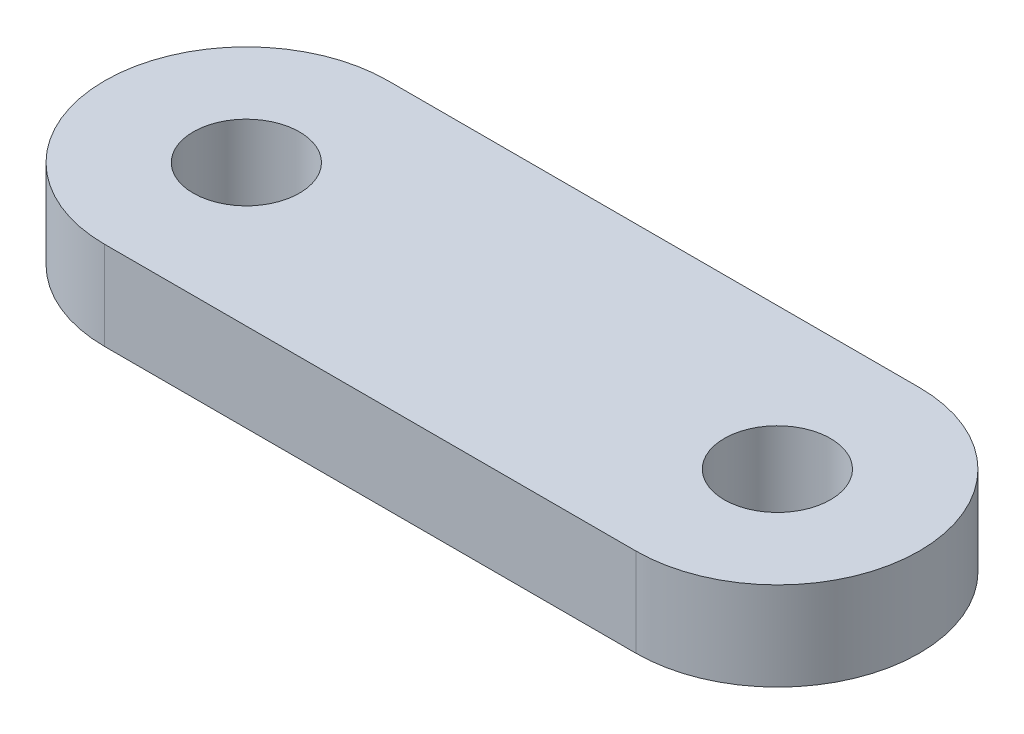
ISO-10303-21;
HEADER;
FILE_DESCRIPTION(('STEP AP214'),'2;1');
FILE_NAME('part.step','',(''),(''),'','','');
FILE_SCHEMA(('AUTOMOTIVE_DESIGN { 1 0 10303 214 1 1 1 1 }'));
ENDSEC;
DATA;
#1=APPLICATION_CONTEXT('core data for automotive mechanical design processes');
#2=APPLICATION_PROTOCOL_DEFINITION('international standard','automotive_design',2000,#1);
#3=PRODUCT_CONTEXT('',#1,'mechanical');
#4=PRODUCT('Part','Part','',(#3));
#5=PRODUCT_RELATED_PRODUCT_CATEGORY('part','',(#4));
#6=PRODUCT_DEFINITION_FORMATION('','',#4);
#7=PRODUCT_DEFINITION_CONTEXT('part definition',#1,'design');
#8=PRODUCT_DEFINITION('design','',#6,#7);
#9=PRODUCT_DEFINITION_SHAPE('','',#8);
#10=(LENGTH_UNIT() NAMED_UNIT(*) SI_UNIT(.MILLI.,.METRE.));
#11=(NAMED_UNIT(*) PLANE_ANGLE_UNIT() SI_UNIT($,.RADIAN.));
#12=(NAMED_UNIT(*) SI_UNIT($,.STERADIAN.) SOLID_ANGLE_UNIT());
#13=UNCERTAINTY_MEASURE_WITH_UNIT(LENGTH_MEASURE(1.E-05),#10,'distance_accuracy_value','');
#14=(GEOMETRIC_REPRESENTATION_CONTEXT(3) GLOBAL_UNCERTAINTY_ASSIGNED_CONTEXT((#13)) GLOBAL_UNIT_ASSIGNED_CONTEXT((#10,
#11,#12)) REPRESENTATION_CONTEXT('',''));
#15=CARTESIAN_POINT('',(0.,0.,0.));
#16=DIRECTION('',(0.,0.,1.));
#17=DIRECTION('',(1.,0.,0.));
#18=AXIS2_PLACEMENT_3D('',#15,#16,#17);
#19=CARTESIAN_POINT('',(0.,2.5,0.));
#20=DIRECTION('',(0.,-1.,0.));
#21=DIRECTION('',(0.,0.,-1.));
#22=AXIS2_PLACEMENT_3D('',#19,#20,#21);
#23=CYLINDRICAL_SURFACE('',#22,4.);
#24=CARTESIAN_POINT('',(0.,0.,0.));
#25=DIRECTION('',(0.,1.,0.));
#26=DIRECTION('',(0.,0.,1.));
#27=AXIS2_PLACEMENT_3D('',#24,#25,#26);
#28=CIRCLE('',#27,4.);
#29=CARTESIAN_POINT('',(0.,0.,-4.));
#30=VERTEX_POINT('',#29);
#31=CARTESIAN_POINT('',(0.,0.,4.));
#32=VERTEX_POINT('',#31);
#33=EDGE_CURVE('E95',#30,#32,#28,.T.);
#34=ORIENTED_EDGE('',*,*,#33,.T.);
#35=DIRECTION('',(0.,-1.,0.));
#36=VECTOR('',#35,1.);
#37=CARTESIAN_POINT('',(0.,2.5,4.));
#38=LINE('',#37,#36);
#39=CARTESIAN_POINT('',(0.,2.5,4.));
#40=VERTEX_POINT('',#39);
#41=EDGE_CURVE('E11',#40,#32,#38,.T.);
#42=ORIENTED_EDGE('',*,*,#41,.F.);
#43=CARTESIAN_POINT('',(0.,2.5,0.));
#44=DIRECTION('',(0.,1.,0.));
#45=DIRECTION('',(0.,0.,1.));
#46=AXIS2_PLACEMENT_3D('',#43,#44,#45);
#47=CIRCLE('',#46,4.);
#48=CARTESIAN_POINT('',(0.,2.5,-4.));
#49=VERTEX_POINT('',#48);
#50=EDGE_CURVE('E83',#49,#40,#47,.T.);
#51=ORIENTED_EDGE('',*,*,#50,.F.);
#52=DIRECTION('',(0.,-1.,0.));
#53=VECTOR('',#52,1.);
#54=CARTESIAN_POINT('',(0.,2.5,-4.));
#55=LINE('',#54,#53);
#56=EDGE_CURVE('E91',#49,#30,#55,.T.);
#57=ORIENTED_EDGE('',*,*,#56,.T.);
#58=EDGE_LOOP('',(#34,#42,#51,#57));
#59=FACE_BOUND('',#58,.T.);
#60=ADVANCED_FACE('F32',(#59),#23,.T.);
#61=CARTESIAN_POINT('',(0.,2.5,4.));
#62=DIRECTION('',(0.,0.,-1.));
#63=DIRECTION('',(-1.,0.,0.));
#64=AXIS2_PLACEMENT_3D('',#61,#62,#63);
#65=PLANE('',#64);
#66=DIRECTION('',(1.,0.,0.));
#67=VECTOR('',#66,1.);
#68=CARTESIAN_POINT('',(0.,0.,4.));
#69=LINE('',#68,#67);
#70=CARTESIAN_POINT('',(15.0000000000001,0.,4.));
#71=VERTEX_POINT('',#70);
#72=EDGE_CURVE('E87',#32,#71,#69,.T.);
#73=ORIENTED_EDGE('',*,*,#72,.T.);
#74=DIRECTION('',(0.,-1.,0.));
#75=VECTOR('',#74,1.);
#76=CARTESIAN_POINT('',(15.0000000000001,2.5,4.));
#77=LINE('',#76,#75);
#78=CARTESIAN_POINT('',(15.0000000000001,2.5,4.));
#79=VERTEX_POINT('',#78);
#80=EDGE_CURVE('E40',#79,#71,#77,.T.);
#81=ORIENTED_EDGE('',*,*,#80,.F.);
#82=DIRECTION('',(1.,0.,0.));
#83=VECTOR('',#82,1.);
#84=CARTESIAN_POINT('',(0.,2.5,4.));
#85=LINE('',#84,#83);
#86=EDGE_CURVE('E78',#40,#79,#85,.T.);
#87=ORIENTED_EDGE('',*,*,#86,.F.);
#88=ORIENTED_EDGE('',*,*,#41,.T.);
#89=EDGE_LOOP('',(#73,#81,#87,#88));
#90=FACE_BOUND('',#89,.T.);
#91=ADVANCED_FACE('F86',(#90),#65,.F.);
#92=CARTESIAN_POINT('',(15.0000000000001,2.5,0.));
#93=DIRECTION('',(0.,-1.,0.));
#94=DIRECTION('',(0.,0.,-1.));
#95=AXIS2_PLACEMENT_3D('',#92,#93,#94);
#96=CYLINDRICAL_SURFACE('',#95,4.);
#97=CARTESIAN_POINT('',(15.0000000000001,0.,0.));
#98=DIRECTION('',(0.,1.,0.));
#99=DIRECTION('',(0.,0.,1.));
#100=AXIS2_PLACEMENT_3D('',#97,#98,#99);
#101=CIRCLE('',#100,4.);
#102=CARTESIAN_POINT('',(15.,0.,-4.));
#103=VERTEX_POINT('',#102);
#104=EDGE_CURVE('E65',#71,#103,#101,.T.);
#105=ORIENTED_EDGE('',*,*,#104,.T.);
#106=DIRECTION('',(0.,-1.,0.));
#107=VECTOR('',#106,1.);
#108=CARTESIAN_POINT('',(15.,2.5,-4.));
#109=LINE('',#108,#107);
#110=CARTESIAN_POINT('',(15.,2.5,-4.));
#111=VERTEX_POINT('',#110);
#112=EDGE_CURVE('E88',#111,#103,#109,.T.);
#113=ORIENTED_EDGE('',*,*,#112,.F.);
#114=CARTESIAN_POINT('',(15.0000000000001,2.5,0.));
#115=DIRECTION('',(0.,1.,0.));
#116=DIRECTION('',(0.,0.,1.));
#117=AXIS2_PLACEMENT_3D('',#114,#115,#116);
#118=CIRCLE('',#117,4.);
#119=EDGE_CURVE('E81',#79,#111,#118,.T.);
#120=ORIENTED_EDGE('',*,*,#119,.F.);
#121=ORIENTED_EDGE('',*,*,#80,.T.);
#122=EDGE_LOOP('',(#105,#113,#120,#121));
#123=FACE_BOUND('',#122,.T.);
#124=ADVANCED_FACE('F89',(#123),#96,.T.);
#125=CARTESIAN_POINT('',(0.,2.5,-4.));
#126=DIRECTION('',(0.,0.,1.));
#127=DIRECTION('',(1.,0.,0.));
#128=AXIS2_PLACEMENT_3D('',#125,#126,#127);
#129=PLANE('',#128);
#130=DIRECTION('',(-1.,0.,0.));
#131=VECTOR('',#130,1.);
#132=CARTESIAN_POINT('',(0.,0.,-4.));
#133=LINE('',#132,#131);
#134=EDGE_CURVE('E71',#103,#30,#133,.T.);
#135=ORIENTED_EDGE('',*,*,#134,.T.);
#136=ORIENTED_EDGE('',*,*,#56,.F.);
#137=DIRECTION('',(-1.,0.,0.));
#138=VECTOR('',#137,1.);
#139=CARTESIAN_POINT('',(0.,2.5,-4.));
#140=LINE('',#139,#138);
#141=EDGE_CURVE('E48',#111,#49,#140,.T.);
#142=ORIENTED_EDGE('',*,*,#141,.F.);
#143=ORIENTED_EDGE('',*,*,#112,.T.);
#144=EDGE_LOOP('',(#135,#136,#142,#143));
#145=FACE_BOUND('',#144,.T.);
#146=ADVANCED_FACE('F103',(#145),#129,.F.);
#147=CARTESIAN_POINT('',(0.,2.5,0.));
#148=DIRECTION('',(0.,1.,0.));
#149=DIRECTION('',(0.,0.,1.));
#150=AXIS2_PLACEMENT_3D('',#147,#148,#149);
#151=PLANE('',#150);
#152=CARTESIAN_POINT('',(14.9931337430829,2.5,0.));
#153=DIRECTION('',(0.,1.,0.));
#154=DIRECTION('',(0.,0.,1.));
#155=AXIS2_PLACEMENT_3D('',#152,#153,#154);
#156=CIRCLE('',#155,1.5);
#157=CARTESIAN_POINT('',(14.9931337430829,2.5,1.50000000000006));
#158=VERTEX_POINT('',#157);
#159=EDGE_CURVE('E117',#158,#158,#156,.T.);
#160=ORIENTED_EDGE('',*,*,#159,.F.);
#161=EDGE_LOOP('',(#160));
#162=FACE_BOUND('',#161,.T.);
#163=CARTESIAN_POINT('',(0.,2.5,0.));
#164=DIRECTION('',(0.,1.,0.));
#165=DIRECTION('',(0.,0.,1.));
#166=AXIS2_PLACEMENT_3D('',#163,#164,#165);
#167=CIRCLE('',#166,1.5);
#168=CARTESIAN_POINT('',(0.,2.5,1.5));
#169=VERTEX_POINT('',#168);
#170=EDGE_CURVE('E111',#169,#169,#167,.T.);
#171=ORIENTED_EDGE('',*,*,#170,.F.);
#172=EDGE_LOOP('',(#171));
#173=FACE_BOUND('',#172,.T.);
#174=ORIENTED_EDGE('',*,*,#50,.T.);
#175=ORIENTED_EDGE('',*,*,#86,.T.);
#176=ORIENTED_EDGE('',*,*,#119,.T.);
#177=ORIENTED_EDGE('',*,*,#141,.T.);
#178=EDGE_LOOP('',(#174,#175,#176,#177));
#179=FACE_BOUND('',#178,.T.);
#180=ADVANCED_FACE('F79',(#162,#173,#179),#151,.T.);
#181=CARTESIAN_POINT('',(0.,0.,0.));
#182=DIRECTION('',(0.,1.,0.));
#183=DIRECTION('',(0.,0.,1.));
#184=AXIS2_PLACEMENT_3D('',#181,#182,#183);
#185=PLANE('',#184);
#186=CARTESIAN_POINT('',(14.9931337430829,0.,0.));
#187=DIRECTION('',(0.,1.,0.));
#188=DIRECTION('',(0.,0.,1.));
#189=AXIS2_PLACEMENT_3D('',#186,#187,#188);
#190=CIRCLE('',#189,1.5);
#191=CARTESIAN_POINT('',(14.9931337430829,0.,1.50000000000006));
#192=VERTEX_POINT('',#191);
#193=EDGE_CURVE('E114',#192,#192,#190,.F.);
#194=ORIENTED_EDGE('',*,*,#193,.F.);
#195=EDGE_LOOP('',(#194));
#196=FACE_BOUND('',#195,.T.);
#197=CARTESIAN_POINT('',(0.,0.,0.));
#198=DIRECTION('',(0.,1.,0.));
#199=DIRECTION('',(0.,0.,1.));
#200=AXIS2_PLACEMENT_3D('',#197,#198,#199);
#201=CIRCLE('',#200,1.5);
#202=CARTESIAN_POINT('',(0.,0.,1.5));
#203=VERTEX_POINT('',#202);
#204=EDGE_CURVE('E98',#203,#203,#201,.F.);
#205=ORIENTED_EDGE('',*,*,#204,.F.);
#206=EDGE_LOOP('',(#205));
#207=FACE_BOUND('',#206,.T.);
#208=ORIENTED_EDGE('',*,*,#33,.F.);
#209=ORIENTED_EDGE('',*,*,#134,.F.);
#210=ORIENTED_EDGE('',*,*,#104,.F.);
#211=ORIENTED_EDGE('',*,*,#72,.F.);
#212=EDGE_LOOP('',(#208,#209,#210,#211));
#213=FACE_BOUND('',#212,.T.);
#214=ADVANCED_FACE('F106',(#196,#207,#213),#185,.F.);
#215=CARTESIAN_POINT('',(0.,-4.24264068711928,0.));
#216=DIRECTION('',(0.,1.,0.));
#217=DIRECTION('',(0.,0.,1.));
#218=AXIS2_PLACEMENT_3D('',#215,#216,#217);
#219=CYLINDRICAL_SURFACE('',#218,1.5);
#220=ORIENTED_EDGE('',*,*,#204,.T.);
#221=EDGE_LOOP('',(#220));
#222=FACE_BOUND('',#221,.T.);
#223=ORIENTED_EDGE('',*,*,#170,.T.);
#224=EDGE_LOOP('',(#223));
#225=FACE_BOUND('',#224,.T.);
#226=ADVANCED_FACE('F128',(#222,#225),#219,.F.);
#227=CARTESIAN_POINT('',(14.9931337430829,-4.24264068711928,0.));
#228=DIRECTION('',(0.,1.,0.));
#229=DIRECTION('',(0.,0.,1.));
#230=AXIS2_PLACEMENT_3D('',#227,#228,#229);
#231=CYLINDRICAL_SURFACE('',#230,1.5);
#232=ORIENTED_EDGE('',*,*,#193,.T.);
#233=EDGE_LOOP('',(#232));
#234=FACE_BOUND('',#233,.T.);
#235=ORIENTED_EDGE('',*,*,#159,.T.);
#236=EDGE_LOOP('',(#235));
#237=FACE_BOUND('',#236,.T.);
#238=ADVANCED_FACE('F121',(#234,#237),#231,.F.);
#239=CLOSED_SHELL('',(#60,#91,#124,#146,#180,#214,#226,#238));
#240=MANIFOLD_SOLID_BREP('B2',#239);
#241=ADVANCED_BREP_SHAPE_REPRESENTATION('',(#18,#240),#14);
#242=SHAPE_DEFINITION_REPRESENTATION(#9,#241);
ENDSEC;
END-ISO-10303-21;
